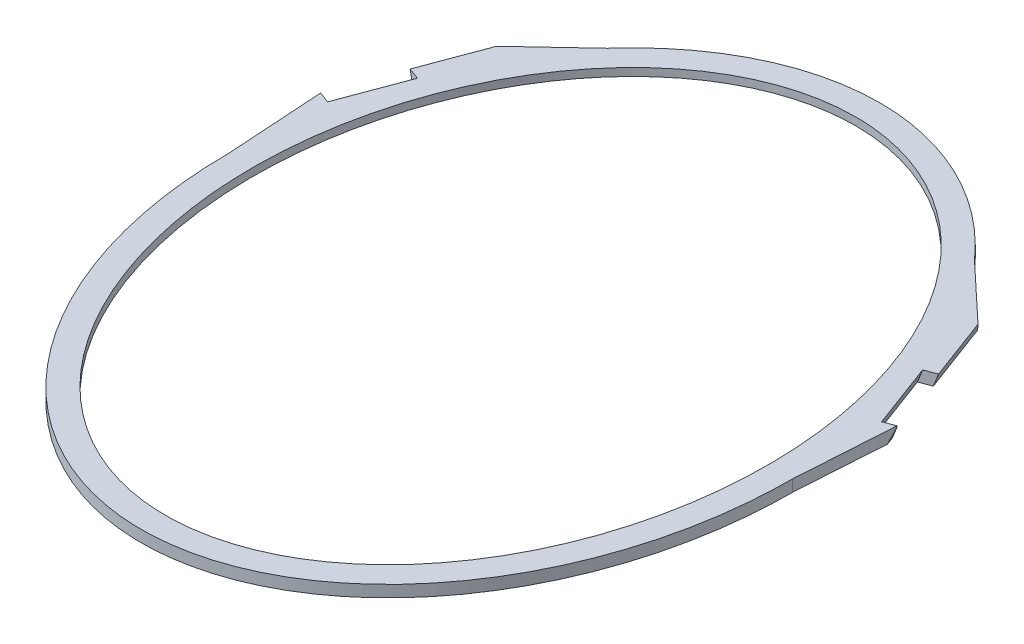
ISO-10303-21;
HEADER;
FILE_DESCRIPTION(('STEP AP214'),'2;1');
FILE_NAME('part.step','',(''),(''),'','','');
FILE_SCHEMA(('AUTOMOTIVE_DESIGN { 1 0 10303 214 1 1 1 1 }'));
ENDSEC;
DATA;
#1=APPLICATION_CONTEXT('core data for automotive mechanical design processes');
#2=APPLICATION_PROTOCOL_DEFINITION('international standard','automotive_design',2000,#1);
#3=PRODUCT_CONTEXT('',#1,'mechanical');
#4=PRODUCT('Part','Part','',(#3));
#5=PRODUCT_RELATED_PRODUCT_CATEGORY('part','',(#4));
#6=PRODUCT_DEFINITION_FORMATION('','',#4);
#7=PRODUCT_DEFINITION_CONTEXT('part definition',#1,'design');
#8=PRODUCT_DEFINITION('design','',#6,#7);
#9=PRODUCT_DEFINITION_SHAPE('','',#8);
#10=(LENGTH_UNIT() NAMED_UNIT(*) SI_UNIT(.MILLI.,.METRE.));
#11=(NAMED_UNIT(*) PLANE_ANGLE_UNIT() SI_UNIT($,.RADIAN.));
#12=(NAMED_UNIT(*) SI_UNIT($,.STERADIAN.) SOLID_ANGLE_UNIT());
#13=UNCERTAINTY_MEASURE_WITH_UNIT(LENGTH_MEASURE(1.E-05),#10,'distance_accuracy_value','');
#14=(GEOMETRIC_REPRESENTATION_CONTEXT(3) GLOBAL_UNCERTAINTY_ASSIGNED_CONTEXT((#13)) GLOBAL_UNIT_ASSIGNED_CONTEXT((#10,
#11,#12)) REPRESENTATION_CONTEXT('',''));
#15=CARTESIAN_POINT('',(0.,0.,0.));
#16=DIRECTION('',(0.,0.,1.));
#17=DIRECTION('',(1.,0.,0.));
#18=AXIS2_PLACEMENT_3D('',#15,#16,#17);
#19=CARTESIAN_POINT('',(0.,12.,0.));
#20=DIRECTION('',(0.,1.,0.));
#21=DIRECTION('',(0.,0.,1.));
#22=AXIS2_PLACEMENT_3D('',#19,#20,#21);
#23=PLANE('',#22);
#24=CARTESIAN_POINT('',(0.,12.,0.));
#25=DIRECTION('',(0.,1.,0.));
#26=DIRECTION('',(0.,0.,-1.));
#27=AXIS2_PLACEMENT_3D('',#24,#25,#26);
#28=ELLIPSE('',#27,355.,265.);
#29=CARTESIAN_POINT('',(0.,12.,-355.));
#30=VERTEX_POINT('',#29);
#31=EDGE_CURVE('E287',#30,#30,#28,.T.);
#32=ORIENTED_EDGE('',*,*,#31,.F.);
#33=EDGE_LOOP('',(#32));
#34=FACE_BOUND('',#33,.T.);
#35=DIRECTION('',(-0.349563318607245,0.,-0.936912742086631));
#36=VECTOR('',#35,1.);
#37=CARTESIAN_POINT('',(281.831851998118,12.,-105.151817291197));
#38=LINE('',#37,#36);
#39=CARTESIAN_POINT('',(284.971367849916,12.,-96.7371689314889));
#40=VERTEX_POINT('',#39);
#41=CARTESIAN_POINT('',(259.863382529132,12.,-164.032534672072));
#42=VERTEX_POINT('',#41);
#43=EDGE_CURVE('E185',#40,#42,#38,.T.);
#44=ORIENTED_EDGE('',*,*,#43,.T.);
#45=DIRECTION('',(0.936912742086632,0.,-0.349563318607243));
#46=VECTOR('',#45,1.);
#47=CARTESIAN_POINT('',(-21.968469468986,12.,-58.8807173808758));
#48=LINE('',#47,#46);
#49=CARTESIAN_POINT('',(271.773456589261,11.9999999999998,-168.476198234641));
#50=VERTEX_POINT('',#49);
#51=EDGE_CURVE('E174',#42,#50,#48,.T.);
#52=ORIENTED_EDGE('',*,*,#51,.T.);
#53=DIRECTION('',(-0.349563318607244,0.,-0.936912742086631));
#54=VECTOR('',#53,1.);
#55=CARTESIAN_POINT('',(293.741926058246,12.,-109.595480853765));
#56=LINE('',#55,#54);
#57=CARTESIAN_POINT('',(247.632092978418,12.,-233.180788145455));
#58=VERTEX_POINT('',#57);
#59=EDGE_CURVE('E183',#50,#58,#56,.T.);
#60=ORIENTED_EDGE('',*,*,#59,.T.);
#61=DIRECTION('',(-0.729121958040292,0.,-0.684383788749771));
#62=VECTOR('',#61,1.);
#63=CARTESIAN_POINT('',(240.893988337172,12.,-239.505449654433));
#64=LINE('',#63,#62);
#65=CARTESIAN_POINT('',(188.989530621689,12.,-288.225103523863));
#66=VERTEX_POINT('',#65);
#67=EDGE_CURVE('E199',#58,#66,#64,.T.);
#68=ORIENTED_EDGE('',*,*,#67,.T.);
#69=CARTESIAN_POINT('',(0.,12.,0.));
#70=DIRECTION('',(0.,1.,0.));
#71=DIRECTION('',(0.,0.,-1.));
#72=AXIS2_PLACEMENT_3D('',#69,#70,#71);
#73=ELLIPSE('',#72,380.,290.);
#74=CARTESIAN_POINT('',(-188.989530621689,12.,-288.225103523863));
#75=VERTEX_POINT('',#74);
#76=EDGE_CURVE('E315',#66,#75,#73,.T.);
#77=ORIENTED_EDGE('',*,*,#76,.T.);
#78=DIRECTION('',(0.729121958040292,0.,-0.68438378874977));
#79=VECTOR('',#78,1.);
#80=CARTESIAN_POINT('',(-247.632092978418,12.,-233.180788145455));
#81=LINE('',#80,#79);
#82=CARTESIAN_POINT('',(-247.632092978418,12.,-233.180788145455));
#83=VERTEX_POINT('',#82);
#84=EDGE_CURVE('E257',#83,#75,#81,.T.);
#85=ORIENTED_EDGE('',*,*,#84,.F.);
#86=DIRECTION('',(-0.349563318607244,0.,0.936912742086631));
#87=VECTOR('',#86,1.);
#88=CARTESIAN_POINT('',(-293.741926058246,12.,-109.595480853765));
#89=LINE('',#88,#87);
#90=CARTESIAN_POINT('',(-271.773456589261,12.,-168.47619823464));
#91=VERTEX_POINT('',#90);
#92=EDGE_CURVE('E247',#83,#91,#89,.T.);
#93=ORIENTED_EDGE('',*,*,#92,.T.);
#94=DIRECTION('',(-0.936912742086632,0.,-0.349563318607243));
#95=VECTOR('',#94,1.);
#96=CARTESIAN_POINT('',(21.968469468986,12.,-58.8807173808758));
#97=LINE('',#96,#95);
#98=CARTESIAN_POINT('',(-259.863382529132,12.,-164.032534672072));
#99=VERTEX_POINT('',#98);
#100=EDGE_CURVE('E231',#99,#91,#97,.T.);
#101=ORIENTED_EDGE('',*,*,#100,.F.);
#102=DIRECTION('',(-0.349563318607245,0.,0.936912742086631));
#103=VECTOR('',#102,1.);
#104=CARTESIAN_POINT('',(-281.831851998118,12.,-105.151817291197));
#105=LINE('',#104,#103);
#106=CARTESIAN_POINT('',(-284.971367849916,12.,-96.7371689314889));
#107=VERTEX_POINT('',#106);
#108=EDGE_CURVE('E240',#99,#107,#105,.T.);
#109=ORIENTED_EDGE('',*,*,#108,.T.);
#110=DIRECTION('',(0.936912742086633,0.,0.349563318607241));
#111=VECTOR('',#110,1.);
#112=CARTESIAN_POINT('',(-3.13951585179758,12.,8.41464835970691));
#113=LINE('',#112,#111);
#114=CARTESIAN_POINT('',(-296.503888020322,12.,-101.039966664492));
#115=VERTEX_POINT('',#114);
#116=EDGE_CURVE('E235',#115,#107,#113,.T.);
#117=ORIENTED_EDGE('',*,*,#116,.F.);
#118=DIRECTION('',(-0.0642365171820711,0.,-0.997934702202663));
#119=VECTOR('',#118,1.);
#120=CARTESIAN_POINT('',(-290.,12.,0.));
#121=LINE('',#120,#119);
#122=CARTESIAN_POINT('',(-290.,12.,-3.60776088669847E-13));
#123=VERTEX_POINT('',#122);
#124=EDGE_CURVE('E254',#123,#115,#121,.T.);
#125=ORIENTED_EDGE('',*,*,#124,.F.);
#126=CARTESIAN_POINT('',(290.,12.,-2.67702931934648E-13));
#127=VERTEX_POINT('',#126);
#128=EDGE_CURVE('E310',#123,#127,#73,.T.);
#129=ORIENTED_EDGE('',*,*,#128,.T.);
#130=DIRECTION('',(0.0642365171820709,0.,-0.997934702202663));
#131=VECTOR('',#130,1.);
#132=CARTESIAN_POINT('',(295.575664034813,12.,-86.6197121551897));
#133=LINE('',#132,#131);
#134=CARTESIAN_POINT('',(296.503888020322,12.,-101.039966664492));
#135=VERTEX_POINT('',#134);
#136=EDGE_CURVE('E201',#127,#135,#133,.T.);
#137=ORIENTED_EDGE('',*,*,#136,.T.);
#138=DIRECTION('',(-0.936912742086633,0.,0.349563318607241));
#139=VECTOR('',#138,1.);
#140=CARTESIAN_POINT('',(3.13951585179761,12.,8.41464835970697));
#141=LINE('',#140,#139);
#142=EDGE_CURVE('E344',#135,#40,#141,.T.);
#143=ORIENTED_EDGE('',*,*,#142,.T.);
#144=EDGE_LOOP('',(#44,#52,#60,#68,#77,#85,#93,#101,#109,#117,#125,#129,#137,#143));
#145=FACE_BOUND('',#144,.T.);
#146=ADVANCED_FACE('F33',(#34,#145),#23,.T.);
#147=CARTESIAN_POINT('',(0.,0.,0.));
#148=DIRECTION('',(0.,1.,0.));
#149=DIRECTION('',(0.,0.,1.));
#150=AXIS2_PLACEMENT_3D('',#147,#148,#149);
#151=PLANE('',#150);
#152=CARTESIAN_POINT('',(0.,0.,0.));
#153=DIRECTION('',(0.,-1.,0.));
#154=DIRECTION('',(0.,0.,1.));
#155=AXIS2_PLACEMENT_3D('',#152,#153,#154);
#156=ELLIPSE('',#155,365.,275.);
#157=CARTESIAN_POINT('',(243.259040827739,0.,-170.232954756121));
#158=VERTEX_POINT('',#157);
#159=CARTESIAN_POINT('',(-243.259040827739,0.,-170.232954756121));
#160=VERTEX_POINT('',#159);
#161=EDGE_CURVE('E282',#158,#160,#156,.T.);
#162=ORIENTED_EDGE('',*,*,#161,.F.);
#163=DIRECTION('',(0.417861896408862,0.,0.908510558843203));
#164=VECTOR('',#163,1.);
#165=CARTESIAN_POINT('',(188.989530621689,0.,-288.225103523863));
#166=LINE('',#165,#164);
#167=CARTESIAN_POINT('',(225.25265776127,0.,-209.382226999064));
#168=VERTEX_POINT('',#167);
#169=EDGE_CURVE('E193',#168,#158,#166,.T.);
#170=ORIENTED_EDGE('',*,*,#169,.F.);
#171=CARTESIAN_POINT('',(-225.25265776127,0.,-209.382226999064));
#172=VERTEX_POINT('',#171);
#173=EDGE_CURVE('E289',#172,#168,#156,.T.);
#174=ORIENTED_EDGE('',*,*,#173,.F.);
#175=DIRECTION('',(-0.417861896408862,0.,0.908510558843203));
#176=VECTOR('',#175,1.);
#177=CARTESIAN_POINT('',(-243.259040827739,0.,-170.232954756121));
#178=LINE('',#177,#176);
#179=EDGE_CURVE('E258',#172,#160,#178,.T.);
#180=ORIENTED_EDGE('',*,*,#179,.T.);
#181=EDGE_LOOP('',(#162,#170,#174,#180));
#182=FACE_BOUND('',#181,.T.);
#183=DIRECTION('',(0.936912742086632,0.,-0.349563318607243));
#184=VECTOR('',#183,1.);
#185=CARTESIAN_POINT('',(-21.968469468986,0.,-58.8807173808758));
#186=LINE('',#185,#184);
#187=CARTESIAN_POINT('',(255.933258600701,0.,-162.566200507484));
#188=VERTEX_POINT('',#187);
#189=CARTESIAN_POINT('',(267.84333266083,-1.33573707650214E-13,-167.009864070053));
#190=VERTEX_POINT('',#189);
#191=EDGE_CURVE('E177',#188,#190,#186,.T.);
#192=ORIENTED_EDGE('',*,*,#191,.F.);
#193=DIRECTION('',(-0.349563318607245,0.,-0.936912742086631));
#194=VECTOR('',#193,1.);
#195=CARTESIAN_POINT('',(277.901728069687,0.,-103.685483126609));
#196=LINE('',#195,#194);
#197=CARTESIAN_POINT('',(281.041243921485,0.,-95.2708347669005));
#198=VERTEX_POINT('',#197);
#199=EDGE_CURVE('E11',#198,#188,#196,.T.);
#200=ORIENTED_EDGE('',*,*,#199,.F.);
#201=DIRECTION('',(-0.936912742086633,0.,0.349563318607241));
#202=VECTOR('',#201,1.);
#203=CARTESIAN_POINT('',(3.13951585179758,0.,8.4146483597069));
#204=LINE('',#203,#202);
#205=CARTESIAN_POINT('',(292.951317981614,-1.04083408558608E-13,-99.7144983294692));
#206=VERTEX_POINT('',#205);
#207=EDGE_CURVE('E341',#206,#198,#204,.T.);
#208=ORIENTED_EDGE('',*,*,#207,.F.);
#209=DIRECTION('',(-0.349563318607244,0.,-0.936912742086631));
#210=VECTOR('',#209,1.);
#211=CARTESIAN_POINT('',(289.811802129816,0.,-108.129146689177));
#212=LINE('',#211,#210);
#213=CARTESIAN_POINT('',(295.908396975203,0.,-91.7888240925696));
#214=VERTEX_POINT('',#213);
#215=EDGE_CURVE('E191',#214,#206,#212,.T.);
#216=ORIENTED_EDGE('',*,*,#215,.F.);
#217=DIRECTION('',(0.0642365171820711,0.,-0.997934702202663));
#218=VECTOR('',#217,1.);
#219=CARTESIAN_POINT('',(290.,0.,0.));
#220=LINE('',#219,#218);
#221=CARTESIAN_POINT('',(290.,0.,-2.67702931934648E-13));
#222=VERTEX_POINT('',#221);
#223=EDGE_CURVE('E202',#222,#214,#220,.T.);
#224=ORIENTED_EDGE('',*,*,#223,.F.);
#225=CARTESIAN_POINT('',(0.,0.,0.));
#226=DIRECTION('',(0.,1.,0.));
#227=DIRECTION('',(0.,0.,-1.));
#228=AXIS2_PLACEMENT_3D('',#225,#226,#227);
#229=ELLIPSE('',#228,380.,290.);
#230=CARTESIAN_POINT('',(-290.,0.,0.));
#231=VERTEX_POINT('',#230);
#232=EDGE_CURVE('E316',#231,#222,#229,.T.);
#233=ORIENTED_EDGE('',*,*,#232,.F.);
#234=DIRECTION('',(-0.0642365171820709,0.,-0.997934702202663));
#235=VECTOR('',#234,1.);
#236=CARTESIAN_POINT('',(-295.575664034813,0.,-86.6197121551897));
#237=LINE('',#236,#235);
#238=CARTESIAN_POINT('',(-295.908396975203,0.,-91.7888240925693));
#239=VERTEX_POINT('',#238);
#240=EDGE_CURVE('E253',#231,#239,#237,.T.);
#241=ORIENTED_EDGE('',*,*,#240,.T.);
#242=DIRECTION('',(-0.349563318607244,0.,0.936912742086631));
#243=VECTOR('',#242,1.);
#244=CARTESIAN_POINT('',(-289.811802129816,0.,-108.129146689177));
#245=LINE('',#244,#243);
#246=CARTESIAN_POINT('',(-292.951317981614,-1.14491749414469E-13,-99.7144983294692));
#247=VERTEX_POINT('',#246);
#248=EDGE_CURVE('E243',#247,#239,#245,.T.);
#249=ORIENTED_EDGE('',*,*,#248,.F.);
#250=DIRECTION('',(0.936912742086633,0.,0.349563318607241));
#251=VECTOR('',#250,1.);
#252=CARTESIAN_POINT('',(-3.13951585179754,0.,8.4146483597068));
#253=LINE('',#252,#251);
#254=CARTESIAN_POINT('',(-281.041243921485,0.,-95.2708347669005));
#255=VERTEX_POINT('',#254);
#256=EDGE_CURVE('E237',#247,#255,#253,.T.);
#257=ORIENTED_EDGE('',*,*,#256,.T.);
#258=DIRECTION('',(-0.349563318607245,0.,0.936912742086631));
#259=VECTOR('',#258,1.);
#260=CARTESIAN_POINT('',(-277.901728069687,0.,-103.685483126609));
#261=LINE('',#260,#259);
#262=CARTESIAN_POINT('',(-255.933258600701,0.,-162.566200507484));
#263=VERTEX_POINT('',#262);
#264=EDGE_CURVE('E324',#263,#255,#261,.T.);
#265=ORIENTED_EDGE('',*,*,#264,.F.);
#266=DIRECTION('',(-0.936912742086632,0.,-0.349563318607243));
#267=VECTOR('',#266,1.);
#268=CARTESIAN_POINT('',(21.968469468986,0.,-58.8807173808758));
#269=LINE('',#268,#267);
#270=CARTESIAN_POINT('',(-267.84333266083,-1.33573707650214E-13,-167.009864070053));
#271=VERTEX_POINT('',#270);
#272=EDGE_CURVE('E227',#263,#271,#269,.T.);
#273=ORIENTED_EDGE('',*,*,#272,.T.);
#274=CARTESIAN_POINT('',(-240.741863407573,0.,-239.648240355678));
#275=VERTEX_POINT('',#274);
#276=EDGE_CURVE('E244',#275,#271,#245,.T.);
#277=ORIENTED_EDGE('',*,*,#276,.F.);
#278=DIRECTION('',(0.729121958040292,0.,-0.684383788749771));
#279=VECTOR('',#278,1.);
#280=CARTESIAN_POINT('',(-240.893988337172,0.,-239.505449654433));
#281=LINE('',#280,#279);
#282=CARTESIAN_POINT('',(-188.989530621689,0.,-288.225103523863));
#283=VERTEX_POINT('',#282);
#284=EDGE_CURVE('E264',#275,#283,#281,.T.);
#285=ORIENTED_EDGE('',*,*,#284,.T.);
#286=CARTESIAN_POINT('',(188.989530621689,0.,-288.225103523863));
#287=VERTEX_POINT('',#286);
#288=EDGE_CURVE('E309',#287,#283,#229,.T.);
#289=ORIENTED_EDGE('',*,*,#288,.F.);
#290=DIRECTION('',(-0.729121958040292,0.,-0.68438378874977));
#291=VECTOR('',#290,1.);
#292=CARTESIAN_POINT('',(247.632092978418,0.,-233.180788145455));
#293=LINE('',#292,#291);
#294=CARTESIAN_POINT('',(240.741863407573,0.,-239.648240355678));
#295=VERTEX_POINT('',#294);
#296=EDGE_CURVE('E207',#295,#287,#293,.T.);
#297=ORIENTED_EDGE('',*,*,#296,.F.);
#298=EDGE_CURVE('E57',#190,#295,#212,.T.);
#299=ORIENTED_EDGE('',*,*,#298,.F.);
#300=EDGE_LOOP('',(#192,#200,#208,#216,#224,#233,#241,#249,#257,#265,#273,#277,#285,#289,#297,#299));
#301=FACE_BOUND('',#300,.T.);
#302=ADVANCED_FACE('F339',(#182,#301),#151,.F.);
#303=CARTESIAN_POINT('',(290.,12.,0.));
#304=DIRECTION('',(-0.997934702202663,0.,-0.0642365171820711));
#305=DIRECTION('',(-0.0642365171820711,0.,0.997934702202663));
#306=AXIS2_PLACEMENT_3D('',#303,#304,#305);
#307=PLANE('',#306);
#308=DIRECTION('',(0.,-1.,0.));
#309=VECTOR('',#308,1.);
#310=CARTESIAN_POINT('',(296.503888020322,12.0000000000009,-101.039966664492));
#311=LINE('',#310,#309);
#312=CARTESIAN_POINT('',(296.503888020322,10.8472000478425,-101.039966664492));
#313=VERTEX_POINT('',#312);
#314=EDGE_CURVE('E49',#135,#313,#311,.T.);
#315=ORIENTED_EDGE('',*,*,#314,.F.);
#316=ORIENTED_EDGE('',*,*,#136,.F.);
#317=DIRECTION('',(0.,-1.,0.));
#318=VECTOR('',#317,1.);
#319=CARTESIAN_POINT('',(290.,12.,0.));
#320=LINE('',#319,#318);
#321=EDGE_CURVE('E211',#127,#222,#320,.T.);
#322=ORIENTED_EDGE('',*,*,#321,.T.);
#323=ORIENTED_EDGE('',*,*,#223,.T.);
#324=DIRECTION('',(-0.0417336482239321,-0.760201576030198,0.648345483833368));
#325=VECTOR('',#324,1.);
#326=CARTESIAN_POINT('',(293.795212461427,-38.4928293159331,-58.9598313176812));
#327=LINE('',#326,#325);
#328=EDGE_CURVE('E190',#313,#214,#327,.T.);
#329=ORIENTED_EDGE('',*,*,#328,.F.);
#330=EDGE_LOOP('',(#315,#316,#322,#323,#329));
#331=FACE_BOUND('',#330,.T.);
#332=ADVANCED_FACE('F335',(#331),#307,.F.);
#333=CARTESIAN_POINT('',(191.680436944293,-48.7819325785392,-322.362586567303));
#334=DIRECTION('',(0.884433277428107,-0.329983164553722,-0.329983164553721));
#335=DIRECTION('',(-0.349563318607246,-0.936912742086631,0.));
#336=AXIS2_PLACEMENT_3D('',#333,#334,#335);
#337=PLANE('',#336);
#338=ORIENTED_EDGE('',*,*,#59,.F.);
#339=DIRECTION('',(-0.309165431544453,-0.943986817233753,0.115350010085919));
#340=VECTOR('',#339,1.);
#341=CARTESIAN_POINT('',(271.773456589261,11.9999999999998,-168.476198234641));
#342=LINE('',#341,#340);
#343=EDGE_CURVE('E170',#50,#190,#342,.T.);
#344=ORIENTED_EDGE('',*,*,#343,.T.);
#345=ORIENTED_EDGE('',*,*,#298,.T.);
#346=DIRECTION('',(0.451100535627729,0.785635133325329,0.423421473287869));
#347=VECTOR('',#346,1.);
#348=CARTESIAN_POINT('',(247.632092978418,11.9999999999998,-233.180788145455));
#349=LINE('',#348,#347);
#350=EDGE_CURVE('E188',#295,#58,#349,.T.);
#351=ORIENTED_EDGE('',*,*,#350,.T.);
#352=EDGE_LOOP('',(#338,#344,#345,#351));
#353=FACE_BOUND('',#352,.T.);
#354=ADVANCED_FACE('F187',(#353),#337,.T.);
#355=ORIENTED_EDGE('',*,*,#215,.T.);
#356=DIRECTION('',(0.309165431544455,0.943986817233753,-0.115350010085911));
#357=VECTOR('',#356,1.);
#358=CARTESIAN_POINT('',(276.974731273112,-48.7819325785412,-93.7536137999221));
#359=LINE('',#358,#357);
#360=EDGE_CURVE('E42',#206,#313,#359,.T.);
#361=ORIENTED_EDGE('',*,*,#360,.T.);
#362=ORIENTED_EDGE('',*,*,#328,.T.);
#363=EDGE_LOOP('',(#355,#361,#362));
#364=FACE_BOUND('',#363,.T.);
#365=ADVANCED_FACE('F331',(#364),#337,.T.);
#366=CARTESIAN_POINT('',(247.632092978418,12.,-233.180788145455));
#367=DIRECTION('',(-0.68438378874977,0.,0.729121958040292));
#368=DIRECTION('',(0.729121958040292,0.,0.68438378874977));
#369=AXIS2_PLACEMENT_3D('',#366,#367,#368);
#370=PLANE('',#369);
#371=ORIENTED_EDGE('',*,*,#350,.F.);
#372=ORIENTED_EDGE('',*,*,#296,.T.);
#373=DIRECTION('',(0.,-1.,0.));
#374=VECTOR('',#373,1.);
#375=CARTESIAN_POINT('',(188.989530621689,12.,-288.225103523863));
#376=LINE('',#375,#374);
#377=EDGE_CURVE('E205',#66,#287,#376,.T.);
#378=ORIENTED_EDGE('',*,*,#377,.F.);
#379=ORIENTED_EDGE('',*,*,#67,.F.);
#380=EDGE_LOOP('',(#371,#372,#378,#379));
#381=FACE_BOUND('',#380,.T.);
#382=ADVANCED_FACE('F392',(#381),#370,.F.);
#383=DIRECTION('',(0.,-1.,0.));
#384=VECTOR('',#383,1.);
#385=SURFACE_OF_LINEAR_EXTRUSION('',#73,#384);
#386=ORIENTED_EDGE('',*,*,#321,.F.);
#387=ORIENTED_EDGE('',*,*,#128,.F.);
#388=DIRECTION('',(0.,-1.,0.));
#389=VECTOR('',#388,1.);
#390=CARTESIAN_POINT('',(-290.,12.,0.));
#391=LINE('',#390,#389);
#392=EDGE_CURVE('E261',#123,#231,#391,.T.);
#393=ORIENTED_EDGE('',*,*,#392,.T.);
#394=ORIENTED_EDGE('',*,*,#232,.T.);
#395=EDGE_LOOP('',(#386,#387,#393,#394));
#396=FACE_BOUND('',#395,.T.);
#397=ADVANCED_FACE('F35',(#396),#385,.F.);
#398=ORIENTED_EDGE('',*,*,#377,.T.);
#399=ORIENTED_EDGE('',*,*,#288,.T.);
#400=DIRECTION('',(0.,-1.,0.));
#401=VECTOR('',#400,1.);
#402=CARTESIAN_POINT('',(-188.989530621689,12.,-288.225103523863));
#403=LINE('',#402,#401);
#404=EDGE_CURVE('E269',#75,#283,#403,.T.);
#405=ORIENTED_EDGE('',*,*,#404,.F.);
#406=ORIENTED_EDGE('',*,*,#76,.F.);
#407=EDGE_LOOP('',(#398,#399,#405,#406));
#408=FACE_BOUND('',#407,.T.);
#409=ADVANCED_FACE('F297',(#408),#385,.F.);
#410=CARTESIAN_POINT('',(0.,4.,0.));
#411=DIRECTION('',(0.,-1.,0.));
#412=DIRECTION('',(0.,0.,1.));
#413=AXIS2_PLACEMENT_3D('',#410,#411,#412);
#414=ELLIPSE('',#413,365.,275.);
#415=DIRECTION('',(0.,-1.,0.));
#416=VECTOR('',#415,1.);
#417=SURFACE_OF_LINEAR_EXTRUSION('',#414,#416);
#418=DIRECTION('',(0.,-1.,0.));
#419=VECTOR('',#418,1.);
#420=CARTESIAN_POINT('',(243.259040827739,4.,-170.232954756122));
#421=LINE('',#420,#419);
#422=CARTESIAN_POINT('',(243.259040827739,4.,-170.232954756122));
#423=VERTEX_POINT('',#422);
#424=EDGE_CURVE('E218',#158,#423,#421,.F.);
#425=ORIENTED_EDGE('',*,*,#424,.F.);
#426=ORIENTED_EDGE('',*,*,#161,.T.);
#427=DIRECTION('',(0.,-1.,0.));
#428=VECTOR('',#427,1.);
#429=CARTESIAN_POINT('',(-243.259040827739,4.,-170.232954756121));
#430=LINE('',#429,#428);
#431=CARTESIAN_POINT('',(-243.259040827739,4.,-170.232954756123));
#432=VERTEX_POINT('',#431);
#433=EDGE_CURVE('E276',#160,#432,#430,.F.);
#434=ORIENTED_EDGE('',*,*,#433,.T.);
#435=EDGE_CURVE('E288',#423,#432,#414,.T.);
#436=ORIENTED_EDGE('',*,*,#435,.F.);
#437=EDGE_LOOP('',(#425,#426,#434,#436));
#438=FACE_BOUND('',#437,.T.);
#439=ADVANCED_FACE('F292',(#438),#417,.F.);
#440=DIRECTION('',(0.,-1.,0.));
#441=VECTOR('',#440,1.);
#442=CARTESIAN_POINT('',(225.25265776127,4.,-209.382226999063));
#443=LINE('',#442,#441);
#444=CARTESIAN_POINT('',(225.25265776127,4.,-209.382226999063));
#445=VERTEX_POINT('',#444);
#446=EDGE_CURVE('E214',#445,#168,#443,.T.);
#447=ORIENTED_EDGE('',*,*,#446,.F.);
#448=CARTESIAN_POINT('',(-225.25265776127,4.,-209.382226999063));
#449=VERTEX_POINT('',#448);
#450=EDGE_CURVE('E283',#449,#445,#414,.T.);
#451=ORIENTED_EDGE('',*,*,#450,.F.);
#452=DIRECTION('',(0.,-1.,0.));
#453=VECTOR('',#452,1.);
#454=CARTESIAN_POINT('',(-225.25265776127,4.,-209.382226999064));
#455=LINE('',#454,#453);
#456=EDGE_CURVE('E272',#449,#172,#455,.T.);
#457=ORIENTED_EDGE('',*,*,#456,.T.);
#458=ORIENTED_EDGE('',*,*,#173,.T.);
#459=EDGE_LOOP('',(#447,#451,#457,#458));
#460=FACE_BOUND('',#459,.T.);
#461=ADVANCED_FACE('F296',(#460),#417,.F.);
#462=CARTESIAN_POINT('',(0.,4.,0.));
#463=DIRECTION('',(0.,-1.,0.));
#464=DIRECTION('',(0.,0.,-1.));
#465=AXIS2_PLACEMENT_3D('',#462,#463,#464);
#466=PLANE('',#465);
#467=CARTESIAN_POINT('',(0.,4.,0.));
#468=DIRECTION('',(0.,-1.,0.));
#469=DIRECTION('',(0.,0.,1.));
#470=AXIS2_PLACEMENT_3D('',#467,#468,#469);
#471=ELLIPSE('',#470,355.,265.);
#472=CARTESIAN_POINT('',(0.,4.,355.));
#473=VERTEX_POINT('',#472);
#474=EDGE_CURVE('E279',#473,#473,#471,.T.);
#475=ORIENTED_EDGE('',*,*,#474,.F.);
#476=EDGE_LOOP('',(#475));
#477=FACE_BOUND('',#476,.T.);
#478=ORIENTED_EDGE('',*,*,#450,.T.);
#479=DIRECTION('',(0.417861896408862,0.,0.908510558843203));
#480=VECTOR('',#479,1.);
#481=CARTESIAN_POINT('',(265.409796635896,4.,-122.073034670043));
#482=LINE('',#481,#480);
#483=EDGE_CURVE('E326',#445,#423,#482,.T.);
#484=ORIENTED_EDGE('',*,*,#483,.T.);
#485=ORIENTED_EDGE('',*,*,#435,.T.);
#486=DIRECTION('',(-0.417861896408862,0.,0.908510558843203));
#487=VECTOR('',#486,1.);
#488=CARTESIAN_POINT('',(-265.409796635896,4.,-122.073034670043));
#489=LINE('',#488,#487);
#490=EDGE_CURVE('E314',#449,#432,#489,.T.);
#491=ORIENTED_EDGE('',*,*,#490,.F.);
#492=EDGE_LOOP('',(#478,#484,#485,#491));
#493=FACE_BOUND('',#492,.T.);
#494=ADVANCED_FACE('F299',(#477,#493),#466,.T.);
#495=CARTESIAN_POINT('',(-191.680436944293,-48.7819325785392,-322.362586567303));
#496=DIRECTION('',(-0.884433277428107,-0.329983164553722,-0.329983164553721));
#497=DIRECTION('',(0.349563318607246,-0.936912742086631,0.));
#498=AXIS2_PLACEMENT_3D('',#495,#496,#497);
#499=PLANE('',#498);
#500=DIRECTION('',(-0.309165431544455,0.943986817233753,-0.115350010085911));
#501=VECTOR('',#500,1.);
#502=CARTESIAN_POINT('',(-276.974731273112,-48.7819325785413,-93.7536137999221));
#503=LINE('',#502,#501);
#504=CARTESIAN_POINT('',(-296.503888020322,10.8472000478424,-101.039966664492));
#505=VERTEX_POINT('',#504);
#506=EDGE_CURVE('E322',#247,#505,#503,.T.);
#507=ORIENTED_EDGE('',*,*,#506,.F.);
#508=ORIENTED_EDGE('',*,*,#248,.T.);
#509=DIRECTION('',(0.0417336482239319,-0.760201576030198,0.648345483833368));
#510=VECTOR('',#509,1.);
#511=CARTESIAN_POINT('',(-296.14866436444,4.37660390929957,-95.5214543166997));
#512=LINE('',#511,#510);
#513=EDGE_CURVE('E320',#505,#239,#512,.T.);
#514=ORIENTED_EDGE('',*,*,#513,.F.);
#515=EDGE_LOOP('',(#507,#508,#514));
#516=FACE_BOUND('',#515,.T.);
#517=ADVANCED_FACE('F367',(#516),#499,.T.);
#518=CARTESIAN_POINT('',(-240.893988337172,12.,-239.505449654433));
#519=DIRECTION('',(-0.684383788749771,0.,-0.729121958040292));
#520=DIRECTION('',(-0.729121958040292,0.,0.684383788749771));
#521=AXIS2_PLACEMENT_3D('',#518,#519,#520);
#522=PLANE('',#521);
#523=ORIENTED_EDGE('',*,*,#284,.F.);
#524=DIRECTION('',(-0.451100535627729,0.785635133325328,0.423421473287869));
#525=VECTOR('',#524,1.);
#526=CARTESIAN_POINT('',(-245.052898551684,7.50808390307229,-235.601725869556));
#527=LINE('',#526,#525);
#528=EDGE_CURVE('E250',#275,#83,#527,.T.);
#529=ORIENTED_EDGE('',*,*,#528,.T.);
#530=ORIENTED_EDGE('',*,*,#84,.T.);
#531=ORIENTED_EDGE('',*,*,#404,.T.);
#532=EDGE_LOOP('',(#523,#529,#530,#531));
#533=FACE_BOUND('',#532,.T.);
#534=ADVANCED_FACE('F385',(#533),#522,.T.);
#535=CARTESIAN_POINT('',(-295.575664034813,12.,-86.6197121551897));
#536=DIRECTION('',(-0.997934702202663,0.,0.0642365171820709));
#537=DIRECTION('',(0.0642365171820709,0.,0.997934702202663));
#538=AXIS2_PLACEMENT_3D('',#535,#536,#537);
#539=PLANE('',#538);
#540=DIRECTION('',(0.,1.,0.));
#541=VECTOR('',#540,1.);
#542=CARTESIAN_POINT('',(-296.503888020322,12.0000000000001,-101.039966664492));
#543=LINE('',#542,#541);
#544=EDGE_CURVE('E233',#505,#115,#543,.T.);
#545=ORIENTED_EDGE('',*,*,#544,.F.);
#546=ORIENTED_EDGE('',*,*,#513,.T.);
#547=ORIENTED_EDGE('',*,*,#240,.F.);
#548=ORIENTED_EDGE('',*,*,#392,.F.);
#549=ORIENTED_EDGE('',*,*,#124,.T.);
#550=EDGE_LOOP('',(#545,#546,#547,#548,#549));
#551=FACE_BOUND('',#550,.T.);
#552=ADVANCED_FACE('F305',(#551),#539,.T.);
#553=DIRECTION('',(0.,-1.,0.));
#554=VECTOR('',#553,1.);
#555=SURFACE_OF_LINEAR_EXTRUSION('',#28,#554);
#556=ORIENTED_EDGE('',*,*,#31,.T.);
#557=EDGE_LOOP('',(#556));
#558=FACE_BOUND('',#557,.T.);
#559=ORIENTED_EDGE('',*,*,#474,.T.);
#560=EDGE_LOOP('',(#559));
#561=FACE_BOUND('',#560,.T.);
#562=ADVANCED_FACE('F301',(#558,#561),#555,.T.);
#563=CARTESIAN_POINT('',(-243.259040827739,12.,-170.232954756121));
#564=DIRECTION('',(0.908510558843203,0.,0.417861896408862));
#565=DIRECTION('',(0.417861896408862,0.,-0.908510558843203));
#566=AXIS2_PLACEMENT_3D('',#563,#564,#565);
#567=PLANE('',#566);
#568=ORIENTED_EDGE('',*,*,#433,.F.);
#569=ORIENTED_EDGE('',*,*,#179,.F.);
#570=ORIENTED_EDGE('',*,*,#456,.F.);
#571=ORIENTED_EDGE('',*,*,#490,.T.);
#572=EDGE_LOOP('',(#568,#569,#570,#571));
#573=FACE_BOUND('',#572,.T.);
#574=ADVANCED_FACE('F304',(#573),#567,.T.);
#575=DIRECTION('',(0.309165431544453,-0.943986817233753,0.115350010085919));
#576=VECTOR('',#575,1.);
#577=CARTESIAN_POINT('',(-271.773456589261,11.9999999999998,-168.476198234641));
#578=LINE('',#577,#576);
#579=EDGE_CURVE('E220',#91,#271,#578,.T.);
#580=ORIENTED_EDGE('',*,*,#579,.F.);
#581=ORIENTED_EDGE('',*,*,#92,.F.);
#582=ORIENTED_EDGE('',*,*,#528,.F.);
#583=ORIENTED_EDGE('',*,*,#276,.T.);
#584=EDGE_LOOP('',(#580,#581,#582,#583));
#585=FACE_BOUND('',#584,.T.);
#586=ADVANCED_FACE('F380',(#585),#499,.T.);
#587=CARTESIAN_POINT('',(-279.778224543276,32.919674609418,-131.575701374327));
#588=DIRECTION('',(-0.884433277428107,-0.329983164553721,-0.329983164553722));
#589=DIRECTION('',(-0.349563318607245,0.,0.936912742086631));
#590=AXIS2_PLACEMENT_3D('',#587,#588,#589);
#591=PLANE('',#590);
#592=DIRECTION('',(0.309165431544453,-0.943986817233753,0.115350010085919));
#593=VECTOR('',#592,1.);
#594=CARTESIAN_POINT('',(-261.160257260123,15.9597979746445,-164.516400259996));
#595=LINE('',#594,#593);
#596=EDGE_CURVE('E221',#99,#263,#595,.T.);
#597=ORIENTED_EDGE('',*,*,#596,.T.);
#598=ORIENTED_EDGE('',*,*,#264,.T.);
#599=DIRECTION('',(-0.309165431544457,0.943986817233752,-0.115350010085912));
#600=VECTOR('',#599,1.);
#601=CARTESIAN_POINT('',(-278.407994724046,-8.04020202535571,-94.2883661902361));
#602=LINE('',#601,#600);
#603=EDGE_CURVE('E224',#255,#107,#602,.T.);
#604=ORIENTED_EDGE('',*,*,#603,.T.);
#605=ORIENTED_EDGE('',*,*,#108,.F.);
#606=EDGE_LOOP('',(#597,#598,#604,#605));
#607=FACE_BOUND('',#606,.T.);
#608=ADVANCED_FACE('F372',(#607),#591,.T.);
#609=CARTESIAN_POINT('',(-291.490168522657,31.9041072234429,-99.1693416346027));
#610=DIRECTION('',(-0.349563318607241,0.,0.936912742086632));
#611=DIRECTION('',(0.936912742086633,0.,0.349563318607241));
#612=AXIS2_PLACEMENT_3D('',#609,#610,#611);
#613=PLANE('',#612);
#614=ORIENTED_EDGE('',*,*,#506,.T.);
#615=ORIENTED_EDGE('',*,*,#544,.T.);
#616=ORIENTED_EDGE('',*,*,#116,.T.);
#617=ORIENTED_EDGE('',*,*,#603,.F.);
#618=ORIENTED_EDGE('',*,*,#256,.F.);
#619=EDGE_LOOP('',(#614,#615,#616,#617,#618));
#620=FACE_BOUND('',#619,.T.);
#621=ADVANCED_FACE('F369',(#620),#613,.F.);
#622=CARTESIAN_POINT('',(-261.160257260123,15.9597979746445,-164.516400259996));
#623=DIRECTION('',(0.349563318607243,0.,-0.936912742086632));
#624=DIRECTION('',(-0.936912742086632,0.,-0.349563318607243));
#625=AXIS2_PLACEMENT_3D('',#622,#623,#624);
#626=PLANE('',#625);
#627=ORIENTED_EDGE('',*,*,#100,.T.);
#628=ORIENTED_EDGE('',*,*,#579,.T.);
#629=ORIENTED_EDGE('',*,*,#272,.F.);
#630=ORIENTED_EDGE('',*,*,#596,.F.);
#631=EDGE_LOOP('',(#627,#628,#629,#630));
#632=FACE_BOUND('',#631,.T.);
#633=ADVANCED_FACE('F378',(#632),#626,.F.);
#634=CARTESIAN_POINT('',(188.989530621689,12.,-288.225103523863));
#635=DIRECTION('',(0.908510558843203,0.,-0.417861896408862));
#636=DIRECTION('',(-0.417861896408862,0.,-0.908510558843203));
#637=AXIS2_PLACEMENT_3D('',#634,#635,#636);
#638=PLANE('',#637);
#639=ORIENTED_EDGE('',*,*,#169,.T.);
#640=ORIENTED_EDGE('',*,*,#424,.T.);
#641=ORIENTED_EDGE('',*,*,#483,.F.);
#642=ORIENTED_EDGE('',*,*,#446,.T.);
#643=EDGE_LOOP('',(#639,#640,#641,#642));
#644=FACE_BOUND('',#643,.T.);
#645=ADVANCED_FACE('F428',(#644),#638,.F.);
#646=CARTESIAN_POINT('',(279.778224543276,32.919674609418,-131.575701374327));
#647=DIRECTION('',(0.884433277428107,-0.329983164553721,-0.329983164553722));
#648=DIRECTION('',(0.349563318607245,0.,0.936912742086631));
#649=AXIS2_PLACEMENT_3D('',#646,#647,#648);
#650=PLANE('',#649);
#651=DIRECTION('',(0.309165431544459,0.943986817233752,-0.115350010085912));
#652=VECTOR('',#651,1.);
#653=CARTESIAN_POINT('',(291.490168522657,31.9041072234429,-99.1693416346027));
#654=LINE('',#653,#652);
#655=EDGE_CURVE('E179',#198,#40,#654,.T.);
#656=ORIENTED_EDGE('',*,*,#655,.F.);
#657=ORIENTED_EDGE('',*,*,#199,.T.);
#658=DIRECTION('',(-0.309165431544453,-0.943986817233753,0.115350010085919));
#659=VECTOR('',#658,1.);
#660=CARTESIAN_POINT('',(261.160257260123,15.9597979746445,-164.516400259996));
#661=LINE('',#660,#659);
#662=EDGE_CURVE('E349',#42,#188,#661,.T.);
#663=ORIENTED_EDGE('',*,*,#662,.F.);
#664=ORIENTED_EDGE('',*,*,#43,.F.);
#665=EDGE_LOOP('',(#656,#657,#663,#664));
#666=FACE_BOUND('',#665,.T.);
#667=ADVANCED_FACE('F430',(#666),#650,.T.);
#668=CARTESIAN_POINT('',(261.160257260123,15.9597979746445,-164.516400259996));
#669=DIRECTION('',(0.349563318607243,0.,0.936912742086632));
#670=DIRECTION('',(0.936912742086632,0.,-0.349563318607243));
#671=AXIS2_PLACEMENT_3D('',#668,#669,#670);
#672=PLANE('',#671);
#673=ORIENTED_EDGE('',*,*,#662,.T.);
#674=ORIENTED_EDGE('',*,*,#191,.T.);
#675=ORIENTED_EDGE('',*,*,#343,.F.);
#676=ORIENTED_EDGE('',*,*,#51,.F.);
#677=EDGE_LOOP('',(#673,#674,#675,#676));
#678=FACE_BOUND('',#677,.T.);
#679=ADVANCED_FACE('F173',(#678),#672,.T.);
#680=CARTESIAN_POINT('',(278.407994724046,-8.04020202535571,-94.2883661902361));
#681=DIRECTION('',(-0.349563318607241,0.,-0.936912742086632));
#682=DIRECTION('',(-0.936912742086633,0.,0.349563318607241));
#683=AXIS2_PLACEMENT_3D('',#680,#681,#682);
#684=PLANE('',#683);
#685=ORIENTED_EDGE('',*,*,#207,.T.);
#686=ORIENTED_EDGE('',*,*,#655,.T.);
#687=ORIENTED_EDGE('',*,*,#142,.F.);
#688=ORIENTED_EDGE('',*,*,#314,.T.);
#689=ORIENTED_EDGE('',*,*,#360,.F.);
#690=EDGE_LOOP('',(#685,#686,#687,#688,#689));
#691=FACE_BOUND('',#690,.T.);
#692=ADVANCED_FACE('F352',(#691),#684,.T.);
#693=CLOSED_SHELL('',(#146,#302,#332,#354,#365,#382,#397,#409,#439,#461,#494,#517,#534,#552,
#562,#574,#586,#608,#621,#633,#645,#667,#679,#692));
#694=MANIFOLD_SOLID_BREP('B2',#693);
#695=ADVANCED_BREP_SHAPE_REPRESENTATION('',(#18,#694),#14);
#696=SHAPE_DEFINITION_REPRESENTATION(#9,#695);
ENDSEC;
END-ISO-10303-21;
